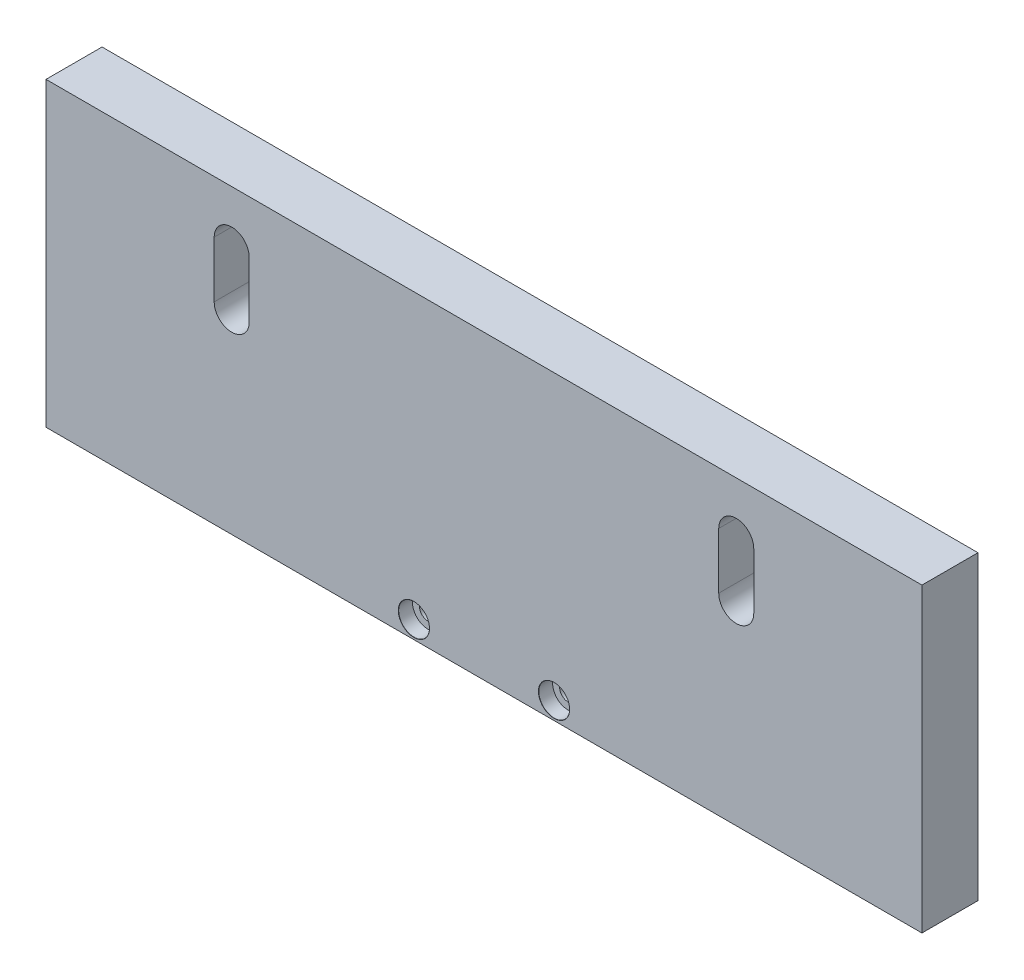
ISO-10303-21;
HEADER;
FILE_DESCRIPTION(('STEP AP214'),'2;1');
FILE_NAME('part.step','',(''),(''),'','','');
FILE_SCHEMA(('AUTOMOTIVE_DESIGN { 1 0 10303 214 1 1 1 1 }'));
ENDSEC;
DATA;
#1=APPLICATION_CONTEXT('core data for automotive mechanical design processes');
#2=APPLICATION_PROTOCOL_DEFINITION('international standard','automotive_design',2000,#1);
#3=PRODUCT_CONTEXT('',#1,'mechanical');
#4=PRODUCT('Part','Part','',(#3));
#5=PRODUCT_RELATED_PRODUCT_CATEGORY('part','',(#4));
#6=PRODUCT_DEFINITION_FORMATION('','',#4);
#7=PRODUCT_DEFINITION_CONTEXT('part definition',#1,'design');
#8=PRODUCT_DEFINITION('design','',#6,#7);
#9=PRODUCT_DEFINITION_SHAPE('','',#8);
#10=(LENGTH_UNIT() NAMED_UNIT(*) SI_UNIT(.MILLI.,.METRE.));
#11=(NAMED_UNIT(*) PLANE_ANGLE_UNIT() SI_UNIT($,.RADIAN.));
#12=(NAMED_UNIT(*) SI_UNIT($,.STERADIAN.) SOLID_ANGLE_UNIT());
#13=UNCERTAINTY_MEASURE_WITH_UNIT(LENGTH_MEASURE(1.E-05),#10,'distance_accuracy_value','');
#14=(GEOMETRIC_REPRESENTATION_CONTEXT(3) GLOBAL_UNCERTAINTY_ASSIGNED_CONTEXT((#13)) GLOBAL_UNIT_ASSIGNED_CONTEXT((#10,
#11,#12)) REPRESENTATION_CONTEXT('',''));
#15=CARTESIAN_POINT('',(0.,0.,0.));
#16=DIRECTION('',(0.,0.,1.));
#17=DIRECTION('',(1.,0.,0.));
#18=AXIS2_PLACEMENT_3D('',#15,#16,#17);
#19=CARTESIAN_POINT('',(-62.5,-21.5,8.));
#20=DIRECTION('',(1.,0.,0.));
#21=DIRECTION('',(0.,0.,-1.));
#22=AXIS2_PLACEMENT_3D('',#19,#20,#21);
#23=PLANE('',#22);
#24=DIRECTION('',(0.,-1.,0.));
#25=VECTOR('',#24,1.);
#26=CARTESIAN_POINT('',(-62.5,-21.5,0.));
#27=LINE('',#26,#25);
#28=CARTESIAN_POINT('',(-62.5,21.5,0.));
#29=VERTEX_POINT('',#28);
#30=CARTESIAN_POINT('',(-62.5,-21.5,0.));
#31=VERTEX_POINT('',#30);
#32=EDGE_CURVE('E177',#29,#31,#27,.T.);
#33=ORIENTED_EDGE('',*,*,#32,.T.);
#34=DIRECTION('',(0.,0.,-1.));
#35=VECTOR('',#34,1.);
#36=CARTESIAN_POINT('',(-62.5,-21.5,8.));
#37=LINE('',#36,#35);
#38=CARTESIAN_POINT('',(-62.5,-21.5,8.));
#39=VERTEX_POINT('',#38);
#40=EDGE_CURVE('E11',#39,#31,#37,.T.);
#41=ORIENTED_EDGE('',*,*,#40,.F.);
#42=DIRECTION('',(0.,-1.,0.));
#43=VECTOR('',#42,1.);
#44=CARTESIAN_POINT('',(-62.5,-21.5,8.));
#45=LINE('',#44,#43);
#46=CARTESIAN_POINT('',(-62.5,21.5,8.));
#47=VERTEX_POINT('',#46);
#48=EDGE_CURVE('E224',#47,#39,#45,.T.);
#49=ORIENTED_EDGE('',*,*,#48,.F.);
#50=DIRECTION('',(0.,0.,-1.));
#51=VECTOR('',#50,1.);
#52=CARTESIAN_POINT('',(-62.5,21.5,8.));
#53=LINE('',#52,#51);
#54=EDGE_CURVE('E238',#47,#29,#53,.T.);
#55=ORIENTED_EDGE('',*,*,#54,.T.);
#56=EDGE_LOOP('',(#33,#41,#49,#55));
#57=FACE_BOUND('',#56,.T.);
#58=ADVANCED_FACE('F38',(#57),#23,.F.);
#59=CARTESIAN_POINT('',(62.5,-21.5,8.));
#60=DIRECTION('',(0.,1.,0.));
#61=DIRECTION('',(-1.,0.,0.));
#62=AXIS2_PLACEMENT_3D('',#59,#60,#61);
#63=PLANE('',#62);
#64=DIRECTION('',(1.,0.,0.));
#65=VECTOR('',#64,1.);
#66=CARTESIAN_POINT('',(62.5,-21.5,0.));
#67=LINE('',#66,#65);
#68=CARTESIAN_POINT('',(62.5,-21.5,0.));
#69=VERTEX_POINT('',#68);
#70=EDGE_CURVE('E242',#31,#69,#67,.T.);
#71=ORIENTED_EDGE('',*,*,#70,.T.);
#72=DIRECTION('',(0.,0.,-1.));
#73=VECTOR('',#72,1.);
#74=CARTESIAN_POINT('',(62.5,-21.5,8.));
#75=LINE('',#74,#73);
#76=CARTESIAN_POINT('',(62.5,-21.5,8.));
#77=VERTEX_POINT('',#76);
#78=EDGE_CURVE('E46',#77,#69,#75,.T.);
#79=ORIENTED_EDGE('',*,*,#78,.F.);
#80=DIRECTION('',(1.,0.,0.));
#81=VECTOR('',#80,1.);
#82=CARTESIAN_POINT('',(62.5,-21.5,8.));
#83=LINE('',#82,#81);
#84=EDGE_CURVE('E228',#39,#77,#83,.T.);
#85=ORIENTED_EDGE('',*,*,#84,.F.);
#86=ORIENTED_EDGE('',*,*,#40,.T.);
#87=EDGE_LOOP('',(#71,#79,#85,#86));
#88=FACE_BOUND('',#87,.T.);
#89=ADVANCED_FACE('F277',(#88),#63,.F.);
#90=CARTESIAN_POINT('',(62.5,-21.5,8.));
#91=DIRECTION('',(-1.,0.,0.));
#92=DIRECTION('',(0.,-1.,0.));
#93=AXIS2_PLACEMENT_3D('',#90,#91,#92);
#94=PLANE('',#93);
#95=DIRECTION('',(0.,1.,0.));
#96=VECTOR('',#95,1.);
#97=CARTESIAN_POINT('',(62.5,-21.5,0.));
#98=LINE('',#97,#96);
#99=CARTESIAN_POINT('',(62.5,21.5,0.));
#100=VERTEX_POINT('',#99);
#101=EDGE_CURVE('E245',#69,#100,#98,.T.);
#102=ORIENTED_EDGE('',*,*,#101,.T.);
#103=DIRECTION('',(0.,0.,-1.));
#104=VECTOR('',#103,1.);
#105=CARTESIAN_POINT('',(62.5,21.5,8.));
#106=LINE('',#105,#104);
#107=CARTESIAN_POINT('',(62.5,21.5,8.));
#108=VERTEX_POINT('',#107);
#109=EDGE_CURVE('E253',#108,#100,#106,.T.);
#110=ORIENTED_EDGE('',*,*,#109,.F.);
#111=DIRECTION('',(0.,1.,0.));
#112=VECTOR('',#111,1.);
#113=CARTESIAN_POINT('',(62.5,-21.5,8.));
#114=LINE('',#113,#112);
#115=EDGE_CURVE('E232',#77,#108,#114,.T.);
#116=ORIENTED_EDGE('',*,*,#115,.F.);
#117=ORIENTED_EDGE('',*,*,#78,.T.);
#118=EDGE_LOOP('',(#102,#110,#116,#117));
#119=FACE_BOUND('',#118,.T.);
#120=ADVANCED_FACE('F262',(#119),#94,.F.);
#121=CARTESIAN_POINT('',(62.5,21.5,8.));
#122=DIRECTION('',(0.,-1.,0.));
#123=DIRECTION('',(1.,0.,0.));
#124=AXIS2_PLACEMENT_3D('',#121,#122,#123);
#125=PLANE('',#124);
#126=DIRECTION('',(-1.,0.,0.));
#127=VECTOR('',#126,1.);
#128=CARTESIAN_POINT('',(62.5,21.5,0.));
#129=LINE('',#128,#127);
#130=EDGE_CURVE('E229',#100,#29,#129,.T.);
#131=ORIENTED_EDGE('',*,*,#130,.T.);
#132=ORIENTED_EDGE('',*,*,#54,.F.);
#133=DIRECTION('',(-1.,0.,0.));
#134=VECTOR('',#133,1.);
#135=CARTESIAN_POINT('',(62.5,21.5,8.));
#136=LINE('',#135,#134);
#137=EDGE_CURVE('E235',#108,#47,#136,.T.);
#138=ORIENTED_EDGE('',*,*,#137,.F.);
#139=ORIENTED_EDGE('',*,*,#109,.T.);
#140=EDGE_LOOP('',(#131,#132,#138,#139));
#141=FACE_BOUND('',#140,.T.);
#142=ADVANCED_FACE('F270',(#141),#125,.F.);
#143=CARTESIAN_POINT('',(0.,0.,8.));
#144=DIRECTION('',(0.,0.,1.));
#145=DIRECTION('',(1.,0.,0.));
#146=AXIS2_PLACEMENT_3D('',#143,#144,#145);
#147=PLANE('',#146);
#148=CARTESIAN_POINT('',(-9.99999999999999,-19.,8.));
#149=DIRECTION('',(0.,0.,1.));
#150=DIRECTION('',(1.,0.,0.));
#151=AXIS2_PLACEMENT_3D('',#148,#149,#150);
#152=CIRCLE('',#151,2.225);
#153=CARTESIAN_POINT('',(-7.77499999999999,-19.,8.));
#154=VERTEX_POINT('',#153);
#155=EDGE_CURVE('E365',#154,#154,#152,.T.);
#156=ORIENTED_EDGE('',*,*,#155,.F.);
#157=EDGE_LOOP('',(#156));
#158=FACE_BOUND('',#157,.T.);
#159=CARTESIAN_POINT('',(9.99999999999999,-19.,8.));
#160=DIRECTION('',(0.,0.,1.));
#161=DIRECTION('',(1.,0.,0.));
#162=AXIS2_PLACEMENT_3D('',#159,#160,#161);
#163=CIRCLE('',#162,2.225);
#164=CARTESIAN_POINT('',(12.225,-19.,8.));
#165=VERTEX_POINT('',#164);
#166=EDGE_CURVE('E391',#165,#165,#163,.T.);
#167=ORIENTED_EDGE('',*,*,#166,.F.);
#168=EDGE_LOOP('',(#167));
#169=FACE_BOUND('',#168,.T.);
#170=CARTESIAN_POINT('',(-36.,14.,8.));
#171=DIRECTION('',(0.,0.,1.));
#172=DIRECTION('',(1.,0.,0.));
#173=AXIS2_PLACEMENT_3D('',#170,#171,#172);
#174=CIRCLE('',#173,2.5);
#175=CARTESIAN_POINT('',(-33.5,14.,8.));
#176=VERTEX_POINT('',#175);
#177=CARTESIAN_POINT('',(-38.5,14.,8.));
#178=VERTEX_POINT('',#177);
#179=EDGE_CURVE('E53',#176,#178,#174,.T.);
#180=ORIENTED_EDGE('',*,*,#179,.F.);
#181=DIRECTION('',(0.,1.,0.));
#182=VECTOR('',#181,1.);
#183=CARTESIAN_POINT('',(-33.5,6.00000000000001,8.));
#184=LINE('',#183,#182);
#185=CARTESIAN_POINT('',(-33.5,6.00000000000001,8.));
#186=VERTEX_POINT('',#185);
#187=EDGE_CURVE('E151',#186,#176,#184,.T.);
#188=ORIENTED_EDGE('',*,*,#187,.F.);
#189=CARTESIAN_POINT('',(-36.,6.00000000000001,8.));
#190=DIRECTION('',(0.,0.,1.));
#191=DIRECTION('',(1.,0.,0.));
#192=AXIS2_PLACEMENT_3D('',#189,#190,#191);
#193=CIRCLE('',#192,2.5);
#194=CARTESIAN_POINT('',(-38.5,6.00000000000001,8.));
#195=VERTEX_POINT('',#194);
#196=EDGE_CURVE('E155',#195,#186,#193,.T.);
#197=ORIENTED_EDGE('',*,*,#196,.F.);
#198=DIRECTION('',(0.,-1.,0.));
#199=VECTOR('',#198,1.);
#200=CARTESIAN_POINT('',(-38.5,6.00000000000001,8.));
#201=LINE('',#200,#199);
#202=EDGE_CURVE('E167',#178,#195,#201,.T.);
#203=ORIENTED_EDGE('',*,*,#202,.F.);
#204=EDGE_LOOP('',(#180,#188,#197,#203));
#205=FACE_BOUND('',#204,.T.);
#206=CARTESIAN_POINT('',(36.,14.,8.));
#207=DIRECTION('',(0.,0.,1.));
#208=DIRECTION('',(-1.,0.,0.));
#209=AXIS2_PLACEMENT_3D('',#206,#207,#208);
#210=CIRCLE('',#209,2.5);
#211=CARTESIAN_POINT('',(38.5,14.,8.));
#212=VERTEX_POINT('',#211);
#213=CARTESIAN_POINT('',(33.5,14.,8.));
#214=VERTEX_POINT('',#213);
#215=EDGE_CURVE('E61',#212,#214,#210,.T.);
#216=ORIENTED_EDGE('',*,*,#215,.F.);
#217=DIRECTION('',(0.,1.,0.));
#218=VECTOR('',#217,1.);
#219=CARTESIAN_POINT('',(38.5,6.00000000000003,8.));
#220=LINE('',#219,#218);
#221=CARTESIAN_POINT('',(38.5,6.00000000000003,8.));
#222=VERTEX_POINT('',#221);
#223=EDGE_CURVE('E188',#222,#212,#220,.T.);
#224=ORIENTED_EDGE('',*,*,#223,.F.);
#225=CARTESIAN_POINT('',(36.,6.00000000000003,8.));
#226=DIRECTION('',(0.,0.,1.));
#227=DIRECTION('',(-1.,0.,0.));
#228=AXIS2_PLACEMENT_3D('',#225,#226,#227);
#229=CIRCLE('',#228,2.5);
#230=CARTESIAN_POINT('',(33.5,6.00000000000003,8.));
#231=VERTEX_POINT('',#230);
#232=EDGE_CURVE('E207',#231,#222,#229,.T.);
#233=ORIENTED_EDGE('',*,*,#232,.F.);
#234=DIRECTION('',(0.,-1.,0.));
#235=VECTOR('',#234,1.);
#236=CARTESIAN_POINT('',(33.5,6.00000000000003,8.));
#237=LINE('',#236,#235);
#238=EDGE_CURVE('E203',#214,#231,#237,.T.);
#239=ORIENTED_EDGE('',*,*,#238,.F.);
#240=EDGE_LOOP('',(#216,#224,#233,#239));
#241=FACE_BOUND('',#240,.T.);
#242=ORIENTED_EDGE('',*,*,#48,.T.);
#243=ORIENTED_EDGE('',*,*,#84,.T.);
#244=ORIENTED_EDGE('',*,*,#115,.T.);
#245=ORIENTED_EDGE('',*,*,#137,.T.);
#246=EDGE_LOOP('',(#242,#243,#244,#245));
#247=FACE_BOUND('',#246,.T.);
#248=ADVANCED_FACE('F276',(#158,#169,#205,#241,#247),#147,.T.);
#249=CARTESIAN_POINT('',(0.,0.,0.));
#250=DIRECTION('',(0.,0.,1.));
#251=DIRECTION('',(1.,0.,0.));
#252=AXIS2_PLACEMENT_3D('',#249,#250,#251);
#253=PLANE('',#252);
#254=CARTESIAN_POINT('',(0.,7.,0.));
#255=DIRECTION('',(0.,0.,-1.));
#256=DIRECTION('',(-1.,0.,0.));
#257=AXIS2_PLACEMENT_3D('',#254,#255,#256);
#258=CIRCLE('',#257,11.);
#259=CARTESIAN_POINT('',(-11.,7.,0.));
#260=VERTEX_POINT('',#259);
#261=EDGE_CURVE('E366',#260,#260,#258,.T.);
#262=ORIENTED_EDGE('',*,*,#261,.F.);
#263=EDGE_LOOP('',(#262));
#264=FACE_BOUND('',#263,.T.);
#265=CARTESIAN_POINT('',(-9.99999999999999,-19.,0.));
#266=DIRECTION('',(0.,0.,1.));
#267=DIRECTION('',(1.,0.,0.));
#268=AXIS2_PLACEMENT_3D('',#265,#266,#267);
#269=CIRCLE('',#268,1.2);
#270=CARTESIAN_POINT('',(-8.8,-19.,0.));
#271=VERTEX_POINT('',#270);
#272=EDGE_CURVE('E387',#271,#271,#269,.T.);
#273=ORIENTED_EDGE('',*,*,#272,.T.);
#274=EDGE_LOOP('',(#273));
#275=FACE_BOUND('',#274,.T.);
#276=CARTESIAN_POINT('',(9.99999999999999,-19.,0.));
#277=DIRECTION('',(0.,0.,1.));
#278=DIRECTION('',(1.,0.,0.));
#279=AXIS2_PLACEMENT_3D('',#276,#277,#278);
#280=CIRCLE('',#279,1.2);
#281=CARTESIAN_POINT('',(11.2,-19.,0.));
#282=VERTEX_POINT('',#281);
#283=EDGE_CURVE('E158',#282,#282,#280,.T.);
#284=ORIENTED_EDGE('',*,*,#283,.T.);
#285=EDGE_LOOP('',(#284));
#286=FACE_BOUND('',#285,.T.);
#287=DIRECTION('',(0.,1.,0.));
#288=VECTOR('',#287,1.);
#289=CARTESIAN_POINT('',(-33.5,6.00000000000001,0.));
#290=LINE('',#289,#288);
#291=CARTESIAN_POINT('',(-33.5,6.00000000000001,0.));
#292=VERTEX_POINT('',#291);
#293=CARTESIAN_POINT('',(-33.5,14.,0.));
#294=VERTEX_POINT('',#293);
#295=EDGE_CURVE('E136',#292,#294,#290,.T.);
#296=ORIENTED_EDGE('',*,*,#295,.T.);
#297=CARTESIAN_POINT('',(-36.,14.,0.));
#298=DIRECTION('',(0.,0.,1.));
#299=DIRECTION('',(1.,0.,0.));
#300=AXIS2_PLACEMENT_3D('',#297,#298,#299);
#301=CIRCLE('',#300,2.5);
#302=CARTESIAN_POINT('',(-38.5,14.,0.));
#303=VERTEX_POINT('',#302);
#304=EDGE_CURVE('E129',#294,#303,#301,.T.);
#305=ORIENTED_EDGE('',*,*,#304,.T.);
#306=DIRECTION('',(0.,-1.,0.));
#307=VECTOR('',#306,1.);
#308=CARTESIAN_POINT('',(-38.5,6.00000000000001,0.));
#309=LINE('',#308,#307);
#310=CARTESIAN_POINT('',(-38.5,6.00000000000001,0.));
#311=VERTEX_POINT('',#310);
#312=EDGE_CURVE('E140',#303,#311,#309,.T.);
#313=ORIENTED_EDGE('',*,*,#312,.T.);
#314=CARTESIAN_POINT('',(-36.,6.00000000000001,0.));
#315=DIRECTION('',(0.,0.,1.));
#316=DIRECTION('',(1.,0.,0.));
#317=AXIS2_PLACEMENT_3D('',#314,#315,#316);
#318=CIRCLE('',#317,2.5);
#319=EDGE_CURVE('E145',#311,#292,#318,.T.);
#320=ORIENTED_EDGE('',*,*,#319,.T.);
#321=EDGE_LOOP('',(#296,#305,#313,#320));
#322=FACE_BOUND('',#321,.T.);
#323=DIRECTION('',(0.,1.,0.));
#324=VECTOR('',#323,1.);
#325=CARTESIAN_POINT('',(38.5,6.00000000000003,0.));
#326=LINE('',#325,#324);
#327=CARTESIAN_POINT('',(38.5,6.00000000000003,0.));
#328=VERTEX_POINT('',#327);
#329=CARTESIAN_POINT('',(38.5,14.,0.));
#330=VERTEX_POINT('',#329);
#331=EDGE_CURVE('E196',#328,#330,#326,.T.);
#332=ORIENTED_EDGE('',*,*,#331,.T.);
#333=CARTESIAN_POINT('',(36.,14.,0.));
#334=DIRECTION('',(0.,0.,1.));
#335=DIRECTION('',(-1.,0.,0.));
#336=AXIS2_PLACEMENT_3D('',#333,#334,#335);
#337=CIRCLE('',#336,2.5);
#338=CARTESIAN_POINT('',(33.5,14.,0.));
#339=VERTEX_POINT('',#338);
#340=EDGE_CURVE('E183',#330,#339,#337,.T.);
#341=ORIENTED_EDGE('',*,*,#340,.T.);
#342=DIRECTION('',(0.,-1.,0.));
#343=VECTOR('',#342,1.);
#344=CARTESIAN_POINT('',(33.5,6.00000000000003,0.));
#345=LINE('',#344,#343);
#346=CARTESIAN_POINT('',(33.5,6.00000000000003,0.));
#347=VERTEX_POINT('',#346);
#348=EDGE_CURVE('E187',#339,#347,#345,.T.);
#349=ORIENTED_EDGE('',*,*,#348,.T.);
#350=CARTESIAN_POINT('',(36.,6.00000000000003,0.));
#351=DIRECTION('',(0.,0.,1.));
#352=DIRECTION('',(-1.,0.,0.));
#353=AXIS2_PLACEMENT_3D('',#350,#351,#352);
#354=CIRCLE('',#353,2.5);
#355=EDGE_CURVE('E192',#347,#328,#354,.T.);
#356=ORIENTED_EDGE('',*,*,#355,.T.);
#357=EDGE_LOOP('',(#332,#341,#349,#356));
#358=FACE_BOUND('',#357,.T.);
#359=ORIENTED_EDGE('',*,*,#32,.F.);
#360=ORIENTED_EDGE('',*,*,#130,.F.);
#361=ORIENTED_EDGE('',*,*,#101,.F.);
#362=ORIENTED_EDGE('',*,*,#70,.F.);
#363=EDGE_LOOP('',(#359,#360,#361,#362));
#364=FACE_BOUND('',#363,.T.);
#365=ADVANCED_FACE('F147',(#264,#275,#286,#322,#358,#364),#253,.F.);
#366=CARTESIAN_POINT('',(36.,14.,0.));
#367=DIRECTION('',(0.,0.,1.));
#368=DIRECTION('',(1.,0.,0.));
#369=AXIS2_PLACEMENT_3D('',#366,#367,#368);
#370=CYLINDRICAL_SURFACE('',#369,2.5);
#371=ORIENTED_EDGE('',*,*,#215,.T.);
#372=DIRECTION('',(0.,0.,1.));
#373=VECTOR('',#372,1.);
#374=CARTESIAN_POINT('',(33.5,14.,0.));
#375=LINE('',#374,#373);
#376=EDGE_CURVE('E200',#339,#214,#375,.T.);
#377=ORIENTED_EDGE('',*,*,#376,.F.);
#378=ORIENTED_EDGE('',*,*,#340,.F.);
#379=DIRECTION('',(0.,0.,1.));
#380=VECTOR('',#379,1.);
#381=CARTESIAN_POINT('',(38.5,14.,0.));
#382=LINE('',#381,#380);
#383=EDGE_CURVE('E168',#330,#212,#382,.T.);
#384=ORIENTED_EDGE('',*,*,#383,.T.);
#385=EDGE_LOOP('',(#371,#377,#378,#384));
#386=FACE_BOUND('',#385,.T.);
#387=ADVANCED_FACE('F289',(#386),#370,.F.);
#388=CARTESIAN_POINT('',(38.5,6.00000000000003,0.));
#389=DIRECTION('',(1.,0.,0.));
#390=DIRECTION('',(0.,1.,0.));
#391=AXIS2_PLACEMENT_3D('',#388,#389,#390);
#392=PLANE('',#391);
#393=ORIENTED_EDGE('',*,*,#223,.T.);
#394=ORIENTED_EDGE('',*,*,#383,.F.);
#395=ORIENTED_EDGE('',*,*,#331,.F.);
#396=DIRECTION('',(0.,0.,1.));
#397=VECTOR('',#396,1.);
#398=CARTESIAN_POINT('',(38.5,6.00000000000003,0.));
#399=LINE('',#398,#397);
#400=EDGE_CURVE('E216',#328,#222,#399,.T.);
#401=ORIENTED_EDGE('',*,*,#400,.T.);
#402=EDGE_LOOP('',(#393,#394,#395,#401));
#403=FACE_BOUND('',#402,.T.);
#404=ADVANCED_FACE('F296',(#403),#392,.F.);
#405=CARTESIAN_POINT('',(36.,6.00000000000003,0.));
#406=DIRECTION('',(0.,0.,1.));
#407=DIRECTION('',(1.,0.,0.));
#408=AXIS2_PLACEMENT_3D('',#405,#406,#407);
#409=CYLINDRICAL_SURFACE('',#408,2.5);
#410=ORIENTED_EDGE('',*,*,#232,.T.);
#411=ORIENTED_EDGE('',*,*,#400,.F.);
#412=ORIENTED_EDGE('',*,*,#355,.F.);
#413=DIRECTION('',(0.,0.,1.));
#414=VECTOR('',#413,1.);
#415=CARTESIAN_POINT('',(33.5,6.00000000000003,0.));
#416=LINE('',#415,#414);
#417=EDGE_CURVE('E219',#347,#231,#416,.T.);
#418=ORIENTED_EDGE('',*,*,#417,.T.);
#419=EDGE_LOOP('',(#410,#411,#412,#418));
#420=FACE_BOUND('',#419,.T.);
#421=ADVANCED_FACE('F300',(#420),#409,.F.);
#422=CARTESIAN_POINT('',(33.5,6.00000000000003,0.));
#423=DIRECTION('',(-1.,0.,0.));
#424=DIRECTION('',(0.,-1.,0.));
#425=AXIS2_PLACEMENT_3D('',#422,#423,#424);
#426=PLANE('',#425);
#427=ORIENTED_EDGE('',*,*,#238,.T.);
#428=ORIENTED_EDGE('',*,*,#417,.F.);
#429=ORIENTED_EDGE('',*,*,#348,.F.);
#430=ORIENTED_EDGE('',*,*,#376,.T.);
#431=EDGE_LOOP('',(#427,#428,#429,#430));
#432=FACE_BOUND('',#431,.T.);
#433=ADVANCED_FACE('F297',(#432),#426,.F.);
#434=CARTESIAN_POINT('',(-36.,14.,0.));
#435=DIRECTION('',(0.,0.,1.));
#436=DIRECTION('',(1.,0.,0.));
#437=AXIS2_PLACEMENT_3D('',#434,#435,#436);
#438=CYLINDRICAL_SURFACE('',#437,2.5);
#439=ORIENTED_EDGE('',*,*,#179,.T.);
#440=DIRECTION('',(0.,0.,1.));
#441=VECTOR('',#440,1.);
#442=CARTESIAN_POINT('',(-38.5,14.,0.));
#443=LINE('',#442,#441);
#444=EDGE_CURVE('E125',#303,#178,#443,.T.);
#445=ORIENTED_EDGE('',*,*,#444,.F.);
#446=ORIENTED_EDGE('',*,*,#304,.F.);
#447=DIRECTION('',(0.,0.,1.));
#448=VECTOR('',#447,1.);
#449=CARTESIAN_POINT('',(-33.5,14.,0.));
#450=LINE('',#449,#448);
#451=EDGE_CURVE('E174',#294,#176,#450,.T.);
#452=ORIENTED_EDGE('',*,*,#451,.T.);
#453=EDGE_LOOP('',(#439,#445,#446,#452));
#454=FACE_BOUND('',#453,.T.);
#455=ADVANCED_FACE('F127',(#454),#438,.F.);
#456=CARTESIAN_POINT('',(-33.5,6.00000000000001,0.));
#457=DIRECTION('',(1.,0.,0.));
#458=DIRECTION('',(0.,0.,-1.));
#459=AXIS2_PLACEMENT_3D('',#456,#457,#458);
#460=PLANE('',#459);
#461=ORIENTED_EDGE('',*,*,#187,.T.);
#462=ORIENTED_EDGE('',*,*,#451,.F.);
#463=ORIENTED_EDGE('',*,*,#295,.F.);
#464=DIRECTION('',(0.,0.,1.));
#465=VECTOR('',#464,1.);
#466=CARTESIAN_POINT('',(-33.5,6.00000000000001,0.));
#467=LINE('',#466,#465);
#468=EDGE_CURVE('E178',#292,#186,#467,.T.);
#469=ORIENTED_EDGE('',*,*,#468,.T.);
#470=EDGE_LOOP('',(#461,#462,#463,#469));
#471=FACE_BOUND('',#470,.T.);
#472=ADVANCED_FACE('F310',(#471),#460,.F.);
#473=CARTESIAN_POINT('',(-36.,6.00000000000001,0.));
#474=DIRECTION('',(0.,0.,1.));
#475=DIRECTION('',(1.,0.,0.));
#476=AXIS2_PLACEMENT_3D('',#473,#474,#475);
#477=CYLINDRICAL_SURFACE('',#476,2.5);
#478=ORIENTED_EDGE('',*,*,#196,.T.);
#479=ORIENTED_EDGE('',*,*,#468,.F.);
#480=ORIENTED_EDGE('',*,*,#319,.F.);
#481=DIRECTION('',(0.,0.,1.));
#482=VECTOR('',#481,1.);
#483=CARTESIAN_POINT('',(-38.5,6.00000000000001,0.));
#484=LINE('',#483,#482);
#485=EDGE_CURVE('E135',#311,#195,#484,.T.);
#486=ORIENTED_EDGE('',*,*,#485,.T.);
#487=EDGE_LOOP('',(#478,#479,#480,#486));
#488=FACE_BOUND('',#487,.T.);
#489=ADVANCED_FACE('F314',(#488),#477,.F.);
#490=CARTESIAN_POINT('',(-38.5,6.00000000000001,0.));
#491=DIRECTION('',(-1.,0.,0.));
#492=DIRECTION('',(0.,0.,1.));
#493=AXIS2_PLACEMENT_3D('',#490,#491,#492);
#494=PLANE('',#493);
#495=ORIENTED_EDGE('',*,*,#202,.T.);
#496=ORIENTED_EDGE('',*,*,#485,.F.);
#497=ORIENTED_EDGE('',*,*,#312,.F.);
#498=ORIENTED_EDGE('',*,*,#444,.T.);
#499=EDGE_LOOP('',(#495,#496,#497,#498));
#500=FACE_BOUND('',#499,.T.);
#501=ADVANCED_FACE('F141',(#500),#494,.F.);
#502=CARTESIAN_POINT('',(9.99999999999999,-19.,8.));
#503=DIRECTION('',(0.,0.,1.));
#504=DIRECTION('',(1.,0.,0.));
#505=AXIS2_PLACEMENT_3D('',#502,#503,#504);
#506=CYLINDRICAL_SURFACE('',#505,1.20000000000001);
#507=ORIENTED_EDGE('',*,*,#283,.F.);
#508=EDGE_LOOP('',(#507));
#509=FACE_BOUND('',#508,.T.);
#510=CARTESIAN_POINT('',(9.99999999999999,-19.,6.00000000000001));
#511=DIRECTION('',(0.,0.,1.));
#512=DIRECTION('',(1.,0.,0.));
#513=AXIS2_PLACEMENT_3D('',#510,#511,#512);
#514=CIRCLE('',#513,1.20000000000001);
#515=CARTESIAN_POINT('',(11.2,-19.,6.00000000000001));
#516=VERTEX_POINT('',#515);
#517=EDGE_CURVE('E402',#516,#516,#514,.T.);
#518=ORIENTED_EDGE('',*,*,#517,.T.);
#519=EDGE_LOOP('',(#518));
#520=FACE_BOUND('',#519,.T.);
#521=ADVANCED_FACE('F313',(#509,#520),#506,.F.);
#522=CARTESIAN_POINT('',(12.2,-19.,6.00000000000001));
#523=DIRECTION('',(0.,0.,-1.));
#524=DIRECTION('',(-1.,0.,0.));
#525=AXIS2_PLACEMENT_3D('',#522,#523,#524);
#526=PLANE('',#525);
#527=ORIENTED_EDGE('',*,*,#517,.F.);
#528=EDGE_LOOP('',(#527));
#529=FACE_BOUND('',#528,.T.);
#530=CARTESIAN_POINT('',(9.99999999999999,-19.,6.00000000000001));
#531=DIRECTION('',(0.,0.,1.));
#532=DIRECTION('',(1.,0.,0.));
#533=AXIS2_PLACEMENT_3D('',#530,#531,#532);
#534=CIRCLE('',#533,2.19999999999999);
#535=CARTESIAN_POINT('',(12.2,-19.,6.00000000000001));
#536=VERTEX_POINT('',#535);
#537=EDGE_CURVE('E399',#536,#536,#534,.T.);
#538=ORIENTED_EDGE('',*,*,#537,.T.);
#539=EDGE_LOOP('',(#538));
#540=FACE_BOUND('',#539,.T.);
#541=ADVANCED_FACE('F323',(#529,#540),#526,.F.);
#542=CARTESIAN_POINT('',(9.99999999999999,-19.,8.));
#543=DIRECTION('',(0.,0.,1.));
#544=DIRECTION('',(1.,0.,0.));
#545=AXIS2_PLACEMENT_3D('',#542,#543,#544);
#546=CYLINDRICAL_SURFACE('',#545,2.19999999999999);
#547=ORIENTED_EDGE('',*,*,#537,.F.);
#548=EDGE_LOOP('',(#547));
#549=FACE_BOUND('',#548,.T.);
#550=CARTESIAN_POINT('',(9.99999999999999,-19.,7.975));
#551=DIRECTION('',(0.,0.,1.));
#552=DIRECTION('',(1.,0.,0.));
#553=AXIS2_PLACEMENT_3D('',#550,#551,#552);
#554=CIRCLE('',#553,2.19999999999999);
#555=CARTESIAN_POINT('',(12.2,-19.,7.975));
#556=VERTEX_POINT('',#555);
#557=EDGE_CURVE('E395',#556,#556,#554,.T.);
#558=ORIENTED_EDGE('',*,*,#557,.T.);
#559=EDGE_LOOP('',(#558));
#560=FACE_BOUND('',#559,.T.);
#561=ADVANCED_FACE('F327',(#549,#560),#546,.F.);
#562=CARTESIAN_POINT('',(9.99999999999999,-19.,8.));
#563=DIRECTION('',(0.,0.,1.));
#564=DIRECTION('',(1.,0.,0.));
#565=AXIS2_PLACEMENT_3D('',#562,#563,#564);
#566=CONICAL_SURFACE('',#565,2.225,0.785398163397448);
#567=ORIENTED_EDGE('',*,*,#557,.F.);
#568=EDGE_LOOP('',(#567));
#569=FACE_BOUND('',#568,.T.);
#570=ORIENTED_EDGE('',*,*,#166,.T.);
#571=EDGE_LOOP('',(#570));
#572=FACE_BOUND('',#571,.T.);
#573=ADVANCED_FACE('F331',(#569,#572),#566,.F.);
#574=CARTESIAN_POINT('',(-9.99999999999999,-19.,8.));
#575=DIRECTION('',(0.,0.,1.));
#576=DIRECTION('',(1.,0.,0.));
#577=AXIS2_PLACEMENT_3D('',#574,#575,#576);
#578=CYLINDRICAL_SURFACE('',#577,1.20000000000001);
#579=ORIENTED_EDGE('',*,*,#272,.F.);
#580=EDGE_LOOP('',(#579));
#581=FACE_BOUND('',#580,.T.);
#582=CARTESIAN_POINT('',(-9.99999999999999,-19.,6.00000000000001));
#583=DIRECTION('',(0.,0.,1.));
#584=DIRECTION('',(1.,0.,0.));
#585=AXIS2_PLACEMENT_3D('',#582,#583,#584);
#586=CIRCLE('',#585,1.20000000000001);
#587=CARTESIAN_POINT('',(-8.79999999999998,-19.,6.00000000000001));
#588=VERTEX_POINT('',#587);
#589=EDGE_CURVE('E383',#588,#588,#586,.T.);
#590=ORIENTED_EDGE('',*,*,#589,.T.);
#591=EDGE_LOOP('',(#590));
#592=FACE_BOUND('',#591,.T.);
#593=ADVANCED_FACE('F335',(#581,#592),#578,.F.);
#594=CARTESIAN_POINT('',(-7.8,-19.,6.00000000000001));
#595=DIRECTION('',(0.,0.,-1.));
#596=DIRECTION('',(-1.,0.,0.));
#597=AXIS2_PLACEMENT_3D('',#594,#595,#596);
#598=PLANE('',#597);
#599=ORIENTED_EDGE('',*,*,#589,.F.);
#600=EDGE_LOOP('',(#599));
#601=FACE_BOUND('',#600,.T.);
#602=CARTESIAN_POINT('',(-9.99999999999999,-19.,6.00000000000001));
#603=DIRECTION('',(0.,0.,1.));
#604=DIRECTION('',(1.,0.,0.));
#605=AXIS2_PLACEMENT_3D('',#602,#603,#604);
#606=CIRCLE('',#605,2.19999999999999);
#607=CARTESIAN_POINT('',(-7.8,-19.,6.00000000000001));
#608=VERTEX_POINT('',#607);
#609=EDGE_CURVE('E379',#608,#608,#606,.T.);
#610=ORIENTED_EDGE('',*,*,#609,.T.);
#611=EDGE_LOOP('',(#610));
#612=FACE_BOUND('',#611,.T.);
#613=ADVANCED_FACE('F339',(#601,#612),#598,.F.);
#614=CARTESIAN_POINT('',(-9.99999999999999,-19.,8.));
#615=DIRECTION('',(0.,0.,1.));
#616=DIRECTION('',(1.,0.,0.));
#617=AXIS2_PLACEMENT_3D('',#614,#615,#616);
#618=CYLINDRICAL_SURFACE('',#617,2.19999999999999);
#619=ORIENTED_EDGE('',*,*,#609,.F.);
#620=EDGE_LOOP('',(#619));
#621=FACE_BOUND('',#620,.T.);
#622=CARTESIAN_POINT('',(-9.99999999999999,-19.,7.975));
#623=DIRECTION('',(0.,0.,1.));
#624=DIRECTION('',(1.,0.,0.));
#625=AXIS2_PLACEMENT_3D('',#622,#623,#624);
#626=CIRCLE('',#625,2.19999999999999);
#627=CARTESIAN_POINT('',(-7.8,-19.,7.975));
#628=VERTEX_POINT('',#627);
#629=EDGE_CURVE('E371',#628,#628,#626,.T.);
#630=ORIENTED_EDGE('',*,*,#629,.T.);
#631=EDGE_LOOP('',(#630));
#632=FACE_BOUND('',#631,.T.);
#633=ADVANCED_FACE('F343',(#621,#632),#618,.F.);
#634=CARTESIAN_POINT('',(-9.99999999999999,-19.,8.));
#635=DIRECTION('',(0.,0.,1.));
#636=DIRECTION('',(1.,0.,0.));
#637=AXIS2_PLACEMENT_3D('',#634,#635,#636);
#638=CONICAL_SURFACE('',#637,2.225,0.785398163397448);
#639=ORIENTED_EDGE('',*,*,#629,.F.);
#640=EDGE_LOOP('',(#639));
#641=FACE_BOUND('',#640,.T.);
#642=ORIENTED_EDGE('',*,*,#155,.T.);
#643=EDGE_LOOP('',(#642));
#644=FACE_BOUND('',#643,.T.);
#645=ADVANCED_FACE('F347',(#641,#644),#638,.F.);
#646=CARTESIAN_POINT('',(0.,7.,7.));
#647=DIRECTION('',(0.,0.,-1.));
#648=DIRECTION('',(-1.,0.,0.));
#649=AXIS2_PLACEMENT_3D('',#646,#647,#648);
#650=CYLINDRICAL_SURFACE('',#649,11.);
#651=CARTESIAN_POINT('',(0.,7.,7.));
#652=DIRECTION('',(0.,0.,-1.));
#653=DIRECTION('',(-1.,0.,0.));
#654=AXIS2_PLACEMENT_3D('',#651,#652,#653);
#655=CIRCLE('',#654,11.);
#656=CARTESIAN_POINT('',(-11.,7.,7.));
#657=VERTEX_POINT('',#656);
#658=EDGE_CURVE('E363',#657,#657,#655,.T.);
#659=ORIENTED_EDGE('',*,*,#658,.F.);
#660=EDGE_LOOP('',(#659));
#661=FACE_BOUND('',#660,.T.);
#662=ORIENTED_EDGE('',*,*,#261,.T.);
#663=EDGE_LOOP('',(#662));
#664=FACE_BOUND('',#663,.T.);
#665=ADVANCED_FACE('F351',(#661,#664),#650,.F.);
#666=CARTESIAN_POINT('',(0.,7.,7.));
#667=DIRECTION('',(0.,0.,-1.));
#668=DIRECTION('',(-1.,0.,0.));
#669=AXIS2_PLACEMENT_3D('',#666,#667,#668);
#670=PLANE('',#669);
#671=ORIENTED_EDGE('',*,*,#658,.T.);
#672=EDGE_LOOP('',(#671));
#673=FACE_BOUND('',#672,.T.);
#674=ADVANCED_FACE('F355',(#673),#670,.T.);
#675=CLOSED_SHELL('',(#58,#89,#120,#142,#248,#365,#387,#404,#421,#433,#455,#472,#489,#501,#521,
#541,#561,#573,#593,#613,#633,#645,#665,#674));
#676=MANIFOLD_SOLID_BREP('B2',#675);
#677=ADVANCED_BREP_SHAPE_REPRESENTATION('',(#18,#676),#14);
#678=SHAPE_DEFINITION_REPRESENTATION(#9,#677);
ENDSEC;
END-ISO-10303-21;
